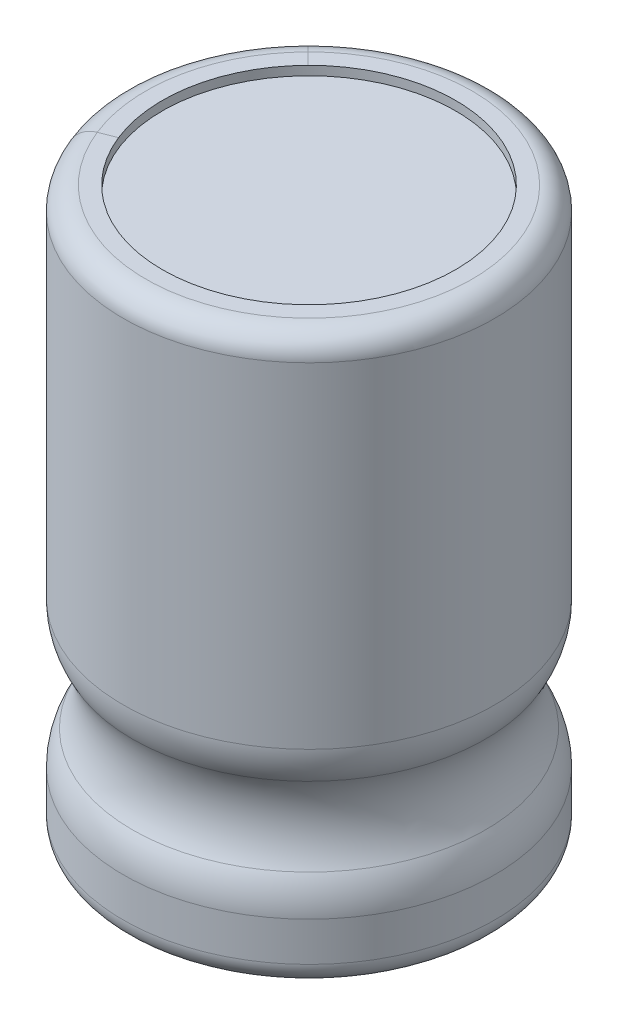
ISO-10303-21;
HEADER;
FILE_DESCRIPTION(('STEP AP214'),'2;1');
FILE_NAME('part.step','',(''),(''),'','','');
FILE_SCHEMA(('AUTOMOTIVE_DESIGN { 1 0 10303 214 1 1 1 1 }'));
ENDSEC;
DATA;
#1=APPLICATION_CONTEXT('core data for automotive mechanical design processes');
#2=APPLICATION_PROTOCOL_DEFINITION('international standard','automotive_design',2000,#1);
#3=PRODUCT_CONTEXT('',#1,'mechanical');
#4=PRODUCT('Part','Part','',(#3));
#5=PRODUCT_RELATED_PRODUCT_CATEGORY('part','',(#4));
#6=PRODUCT_DEFINITION_FORMATION('','',#4);
#7=PRODUCT_DEFINITION_CONTEXT('part definition',#1,'design');
#8=PRODUCT_DEFINITION('design','',#6,#7);
#9=PRODUCT_DEFINITION_SHAPE('','',#8);
#10=(LENGTH_UNIT() NAMED_UNIT(*) SI_UNIT(.MILLI.,.METRE.));
#11=(NAMED_UNIT(*) PLANE_ANGLE_UNIT() SI_UNIT($,.RADIAN.));
#12=(NAMED_UNIT(*) SI_UNIT($,.STERADIAN.) SOLID_ANGLE_UNIT());
#13=UNCERTAINTY_MEASURE_WITH_UNIT(LENGTH_MEASURE(1.E-05),#10,'distance_accuracy_value','');
#14=(GEOMETRIC_REPRESENTATION_CONTEXT(3) GLOBAL_UNCERTAINTY_ASSIGNED_CONTEXT((#13)) GLOBAL_UNIT_ASSIGNED_CONTEXT((#10,
#11,#12)) REPRESENTATION_CONTEXT('',''));
#15=CARTESIAN_POINT('',(0.,0.,0.));
#16=DIRECTION('',(0.,0.,1.));
#17=DIRECTION('',(1.,0.,0.));
#18=AXIS2_PLACEMENT_3D('',#15,#16,#17);
#19=CARTESIAN_POINT('',(0.,0.5,0.));
#20=DIRECTION('',(0.,1.,0.));
#21=DIRECTION('',(0.,0.,1.));
#22=AXIS2_PLACEMENT_3D('',#19,#20,#21);
#23=TOROIDAL_SURFACE('',#22,3.6,0.5);
#24=CARTESIAN_POINT('',(0.,0.,0.));
#25=DIRECTION('',(0.,1.,0.));
#26=DIRECTION('',(0.,0.,1.));
#27=AXIS2_PLACEMENT_3D('',#24,#25,#26);
#28=CIRCLE('',#27,3.6);
#29=CARTESIAN_POINT('',(-2.55822457726929,0.,-2.53288116820654));
#30=VERTEX_POINT('',#29);
#31=CARTESIAN_POINT('',(-3.34559380354316,0.,1.32928631291142));
#32=VERTEX_POINT('',#31);
#33=EDGE_CURVE('E139',#30,#32,#28,.F.);
#34=ORIENTED_EDGE('',*,*,#33,.F.);
#35=CARTESIAN_POINT('',(-2.5582245772693,0.5,-2.53288116820654));
#36=DIRECTION('',(-0.703578102279595,0.,0.71061793813036));
#37=DIRECTION('',(0.71061793813036,0.,0.703578102279595));
#38=AXIS2_PLACEMENT_3D('',#35,#36,#37);
#39=CIRCLE('',#38,0.5);
#40=CARTESIAN_POINT('',(-2.91353354633447,0.5,-2.88467021934634));
#41=VERTEX_POINT('',#40);
#42=EDGE_CURVE('E11',#30,#41,#39,.F.);
#43=ORIENTED_EDGE('',*,*,#42,.T.);
#44=CARTESIAN_POINT('',(0.,0.5,0.));
#45=DIRECTION('',(0.,1.,0.));
#46=DIRECTION('',(0.,0.,1.));
#47=AXIS2_PLACEMENT_3D('',#44,#45,#46);
#48=CIRCLE('',#47,4.1);
#49=CARTESIAN_POINT('',(-3.81025960959082,0.5,1.5139094119269));
#50=VERTEX_POINT('',#49);
#51=EDGE_CURVE('E133',#50,#41,#48,.T.);
#52=ORIENTED_EDGE('',*,*,#51,.F.);
#53=CARTESIAN_POINT('',(-3.34559380354316,0.5,1.32928631291142));
#54=DIRECTION('',(-0.36924619803095,0.,-0.929331612095321));
#55=DIRECTION('',(-0.929331612095321,0.,0.36924619803095));
#56=AXIS2_PLACEMENT_3D('',#53,#54,#55);
#57=CIRCLE('',#56,0.5);
#58=EDGE_CURVE('E48',#50,#32,#57,.F.);
#59=ORIENTED_EDGE('',*,*,#58,.T.);
#60=EDGE_LOOP('',(#34,#43,#52,#59));
#61=FACE_BOUND('',#60,.T.);
#62=ADVANCED_FACE('F38',(#61),#23,.T.);
#63=CARTESIAN_POINT('',(0.,12.5,0.));
#64=DIRECTION('',(0.,-1.,0.));
#65=DIRECTION('',(0.,0.,-1.));
#66=AXIS2_PLACEMENT_3D('',#63,#64,#65);
#67=CYLINDRICAL_SURFACE('',#66,4.1);
#68=DIRECTION('',(0.,-1.,0.));
#69=VECTOR('',#68,1.);
#70=CARTESIAN_POINT('',(-2.91353354633447,12.5,-2.88467021934634));
#71=LINE('',#70,#69);
#72=CARTESIAN_POINT('',(-2.91353354633447,1.3642201591767,-2.88467021934634));
#73=VERTEX_POINT('',#72);
#74=EDGE_CURVE('E165',#73,#41,#71,.T.);
#75=ORIENTED_EDGE('',*,*,#74,.F.);
#76=CARTESIAN_POINT('',(0.,1.3642201591767,0.));
#77=DIRECTION('',(0.,1.,0.));
#78=DIRECTION('',(0.,0.,1.));
#79=AXIS2_PLACEMENT_3D('',#76,#77,#78);
#80=CIRCLE('',#79,4.1);
#81=CARTESIAN_POINT('',(-3.81025960959082,1.3642201591767,1.5139094119269));
#82=VERTEX_POINT('',#81);
#83=EDGE_CURVE('E161',#73,#82,#80,.F.);
#84=ORIENTED_EDGE('',*,*,#83,.T.);
#85=DIRECTION('',(0.,-1.,0.));
#86=VECTOR('',#85,1.);
#87=CARTESIAN_POINT('',(-3.81025960959082,12.5,1.5139094119269));
#88=LINE('',#87,#86);
#89=EDGE_CURVE('E169',#50,#82,#88,.F.);
#90=ORIENTED_EDGE('',*,*,#89,.F.);
#91=ORIENTED_EDGE('',*,*,#51,.T.);
#92=EDGE_LOOP('',(#75,#84,#90,#91));
#93=FACE_BOUND('',#92,.T.);
#94=ADVANCED_FACE('F249',(#93),#67,.T.);
#95=CARTESIAN_POINT('',(0.,1.3642201591767,0.));
#96=DIRECTION('',(0.,1.,0.));
#97=DIRECTION('',(0.,0.,1.));
#98=AXIS2_PLACEMENT_3D('',#95,#96,#97);
#99=TOROIDAL_SURFACE('',#98,2.6,1.5);
#100=ORIENTED_EDGE('',*,*,#83,.F.);
#101=CARTESIAN_POINT('',(-1.84760663913893,1.3642201591767,-1.82930306592695));
#102=DIRECTION('',(-0.703578102279595,0.,0.71061793813036));
#103=DIRECTION('',(0.71061793813036,0.,0.703578102279595));
#104=AXIS2_PLACEMENT_3D('',#101,#102,#103);
#105=CIRCLE('',#104,1.5);
#106=CARTESIAN_POINT('',(-2.76822505052599,2.12028418742968,-2.74080124244572));
#107=VERTEX_POINT('',#106);
#108=EDGE_CURVE('E170',#73,#107,#105,.F.);
#109=ORIENTED_EDGE('',*,*,#108,.T.);
#110=CARTESIAN_POINT('',(0.,2.12028418742968,0.));
#111=DIRECTION('',(0.,1.,0.));
#112=DIRECTION('',(0.,0.,1.));
#113=AXIS2_PLACEMENT_3D('',#110,#111,#112);
#114=CIRCLE('',#113,3.89551811457111);
#115=CARTESIAN_POINT('',(-3.62022812936089,2.12028418742968,1.43840525316608));
#116=VERTEX_POINT('',#115);
#117=EDGE_CURVE('E153',#116,#107,#114,.T.);
#118=ORIENTED_EDGE('',*,*,#117,.F.);
#119=CARTESIAN_POINT('',(-2.41626219144783,1.3642201591767,0.96004011488047));
#120=DIRECTION('',(-0.36924619803095,0.,-0.929331612095321));
#121=DIRECTION('',(-0.929331612095321,0.,0.36924619803095));
#122=AXIS2_PLACEMENT_3D('',#119,#120,#121);
#123=CIRCLE('',#122,1.5);
#124=EDGE_CURVE('E173',#116,#82,#123,.F.);
#125=ORIENTED_EDGE('',*,*,#124,.T.);
#126=EDGE_LOOP('',(#100,#109,#118,#125));
#127=FACE_BOUND('',#126,.T.);
#128=ADVANCED_FACE('F246',(#127),#99,.T.);
#129=CARTESIAN_POINT('',(0.,2.98779587164433,0.));
#130=DIRECTION('',(0.,-1.,0.));
#131=DIRECTION('',(0.,0.,-1.));
#132=AXIS2_PLACEMENT_3D('',#129,#130,#131);
#133=TOROIDAL_SURFACE('',#132,5.38200214172298,1.72110757514648);
#134=CARTESIAN_POINT('',(-3.82454726496436,2.98779587164433,-3.78665885333817));
#135=DIRECTION('',(-0.703578102279595,0.,0.71061793813036));
#136=DIRECTION('',(0.71061793813036,0.,0.703578102279595));
#137=AXIS2_PLACEMENT_3D('',#134,#135,#136);
#138=CIRCLE('',#137,1.72110757514648);
#139=CARTESIAN_POINT('',(-2.76822505052599,3.85530755585897,-2.74080124244573));
#140=VERTEX_POINT('',#139);
#141=EDGE_CURVE('E174',#140,#107,#138,.F.);
#142=ORIENTED_EDGE('',*,*,#141,.F.);
#143=CARTESIAN_POINT('',(0.,3.85530755585897,0.));
#144=DIRECTION('',(0.,-1.,0.));
#145=DIRECTION('',(0.,0.,-1.));
#146=AXIS2_PLACEMENT_3D('',#143,#144,#145);
#147=CIRCLE('',#146,3.89551811457111);
#148=CARTESIAN_POINT('',(-3.62022812936089,3.85530755585897,1.43840525316608));
#149=VERTEX_POINT('',#148);
#150=EDGE_CURVE('E157',#140,#149,#147,.T.);
#151=ORIENTED_EDGE('',*,*,#150,.T.);
#152=CARTESIAN_POINT('',(-5.00166472666789,2.98779587164433,1.98728382862564));
#153=DIRECTION('',(-0.36924619803095,0.,-0.929331612095321));
#154=DIRECTION('',(-0.929331612095321,0.,0.36924619803095));
#155=AXIS2_PLACEMENT_3D('',#152,#153,#154);
#156=CIRCLE('',#155,1.72110757514648);
#157=EDGE_CURVE('E178',#116,#149,#156,.F.);
#158=ORIENTED_EDGE('',*,*,#157,.F.);
#159=ORIENTED_EDGE('',*,*,#117,.T.);
#160=EDGE_LOOP('',(#142,#151,#158,#159));
#161=FACE_BOUND('',#160,.T.);
#162=ADVANCED_FACE('F234',(#161),#133,.F.);
#163=CARTESIAN_POINT('',(0.,4.61137158411196,0.));
#164=DIRECTION('',(0.,-1.,0.));
#165=DIRECTION('',(0.,0.,-1.));
#166=AXIS2_PLACEMENT_3D('',#163,#164,#165);
#167=TOROIDAL_SURFACE('',#166,2.6,1.5);
#168=ORIENTED_EDGE('',*,*,#150,.F.);
#169=CARTESIAN_POINT('',(-1.84760663913893,4.61137158411196,-1.82930306592695));
#170=DIRECTION('',(-0.703578102279595,0.,0.71061793813036));
#171=DIRECTION('',(0.71061793813036,0.,0.703578102279595));
#172=AXIS2_PLACEMENT_3D('',#169,#170,#171);
#173=CIRCLE('',#172,1.5);
#174=CARTESIAN_POINT('',(-2.91353354633447,4.61137158411196,-2.88467021934634));
#175=VERTEX_POINT('',#174);
#176=EDGE_CURVE('E179',#140,#175,#173,.F.);
#177=ORIENTED_EDGE('',*,*,#176,.T.);
#178=CARTESIAN_POINT('',(0.,4.61137158411196,0.));
#179=DIRECTION('',(0.,-1.,0.));
#180=DIRECTION('',(0.,0.,-1.));
#181=AXIS2_PLACEMENT_3D('',#178,#179,#180);
#182=CIRCLE('',#181,4.1);
#183=CARTESIAN_POINT('',(-3.81025960959082,4.61137158411196,1.5139094119269));
#184=VERTEX_POINT('',#183);
#185=EDGE_CURVE('E149',#184,#175,#182,.F.);
#186=ORIENTED_EDGE('',*,*,#185,.F.);
#187=CARTESIAN_POINT('',(-2.41626219144783,4.61137158411196,0.96004011488047));
#188=DIRECTION('',(-0.36924619803095,0.,-0.929331612095321));
#189=DIRECTION('',(-0.929331612095321,0.,0.36924619803095));
#190=AXIS2_PLACEMENT_3D('',#187,#188,#189);
#191=CIRCLE('',#190,1.5);
#192=EDGE_CURVE('E182',#184,#149,#191,.F.);
#193=ORIENTED_EDGE('',*,*,#192,.T.);
#194=EDGE_LOOP('',(#168,#177,#186,#193));
#195=FACE_BOUND('',#194,.T.);
#196=ADVANCED_FACE('F231',(#195),#167,.T.);
#197=DIRECTION('',(0.,-1.,0.));
#198=VECTOR('',#197,1.);
#199=CARTESIAN_POINT('',(-2.91353354633447,12.5,-2.88467021934634));
#200=LINE('',#199,#198);
#201=CARTESIAN_POINT('',(-2.91353354633447,12.,-2.88467021934634));
#202=VERTEX_POINT('',#201);
#203=EDGE_CURVE('E183',#202,#175,#200,.T.);
#204=ORIENTED_EDGE('',*,*,#203,.F.);
#205=CARTESIAN_POINT('',(0.,12.,0.));
#206=DIRECTION('',(0.,1.,0.));
#207=DIRECTION('',(0.,0.,1.));
#208=AXIS2_PLACEMENT_3D('',#205,#206,#207);
#209=CIRCLE('',#208,4.1);
#210=CARTESIAN_POINT('',(-3.81025960959082,12.,1.5139094119269));
#211=VERTEX_POINT('',#210);
#212=EDGE_CURVE('E145',#202,#211,#209,.F.);
#213=ORIENTED_EDGE('',*,*,#212,.T.);
#214=DIRECTION('',(0.,-1.,0.));
#215=VECTOR('',#214,1.);
#216=CARTESIAN_POINT('',(-3.81025960959082,12.5,1.5139094119269));
#217=LINE('',#216,#215);
#218=EDGE_CURVE('E187',#184,#211,#217,.F.);
#219=ORIENTED_EDGE('',*,*,#218,.F.);
#220=ORIENTED_EDGE('',*,*,#185,.T.);
#221=EDGE_LOOP('',(#204,#213,#219,#220));
#222=FACE_BOUND('',#221,.T.);
#223=ADVANCED_FACE('F216',(#222),#67,.T.);
#224=CARTESIAN_POINT('',(0.,12.,0.));
#225=DIRECTION('',(0.,1.,0.));
#226=DIRECTION('',(0.,0.,1.));
#227=AXIS2_PLACEMENT_3D('',#224,#225,#226);
#228=TOROIDAL_SURFACE('',#227,3.6,0.5);
#229=ORIENTED_EDGE('',*,*,#212,.F.);
#230=CARTESIAN_POINT('',(-2.5582245772693,12.,-2.53288116820654));
#231=DIRECTION('',(-0.703578102279595,0.,0.71061793813036));
#232=DIRECTION('',(0.71061793813036,0.,0.703578102279595));
#233=AXIS2_PLACEMENT_3D('',#230,#231,#232);
#234=CIRCLE('',#233,0.5);
#235=CARTESIAN_POINT('',(-2.5582245772693,12.5,-2.53288116820654));
#236=VERTEX_POINT('',#235);
#237=EDGE_CURVE('E188',#202,#236,#234,.F.);
#238=ORIENTED_EDGE('',*,*,#237,.T.);
#239=CARTESIAN_POINT('',(0.,12.5,0.));
#240=DIRECTION('',(0.,1.,0.));
#241=DIRECTION('',(0.,0.,1.));
#242=AXIS2_PLACEMENT_3D('',#239,#240,#241);
#243=CIRCLE('',#242,3.6);
#244=CARTESIAN_POINT('',(-3.34559380354316,12.5,1.32928631291142));
#245=VERTEX_POINT('',#244);
#246=EDGE_CURVE('E118',#245,#236,#243,.T.);
#247=ORIENTED_EDGE('',*,*,#246,.F.);
#248=CARTESIAN_POINT('',(-3.34559380354316,12.,1.32928631291142));
#249=DIRECTION('',(-0.36924619803095,0.,-0.929331612095321));
#250=DIRECTION('',(-0.929331612095321,0.,0.36924619803095));
#251=AXIS2_PLACEMENT_3D('',#248,#249,#250);
#252=CIRCLE('',#251,0.5);
#253=EDGE_CURVE('E124',#245,#211,#252,.F.);
#254=ORIENTED_EDGE('',*,*,#253,.T.);
#255=EDGE_LOOP('',(#229,#238,#247,#254));
#256=FACE_BOUND('',#255,.T.);
#257=ADVANCED_FACE('F211',(#256),#228,.T.);
#258=CARTESIAN_POINT('',(0.,12.5,0.));
#259=DIRECTION('',(0.,1.,0.));
#260=DIRECTION('',(0.,0.,1.));
#261=AXIS2_PLACEMENT_3D('',#258,#259,#260);
#262=PLANE('',#261);
#263=ORIENTED_EDGE('',*,*,#246,.T.);
#264=DIRECTION('',(0.71061793813036,0.,0.703578102279595));
#265=VECTOR('',#264,1.);
#266=CARTESIAN_POINT('',(0.,12.5,0.));
#267=LINE('',#266,#265);
#268=CARTESIAN_POINT('',(-2.3002480800384,12.5,-2.2774603511751));
#269=VERTEX_POINT('',#268);
#270=EDGE_CURVE('E111',#236,#269,#267,.T.);
#271=ORIENTED_EDGE('',*,*,#270,.T.);
#272=CARTESIAN_POINT('',(0.,12.5,0.));
#273=DIRECTION('',(0.,1.,0.));
#274=DIRECTION('',(0.,0.,1.));
#275=AXIS2_PLACEMENT_3D('',#272,#273,#274);
#276=CIRCLE('',#275,3.236968779722);
#277=CARTESIAN_POINT('',(-3.00821741436127,12.5,1.19523841505723));
#278=VERTEX_POINT('',#277);
#279=EDGE_CURVE('E115',#278,#269,#276,.T.);
#280=ORIENTED_EDGE('',*,*,#279,.F.);
#281=DIRECTION('',(-0.929331612095321,0.,0.36924619803095));
#282=VECTOR('',#281,1.);
#283=CARTESIAN_POINT('',(0.,12.5,0.));
#284=LINE('',#283,#282);
#285=EDGE_CURVE('E42',#278,#245,#284,.T.);
#286=ORIENTED_EDGE('',*,*,#285,.T.);
#287=EDGE_LOOP('',(#263,#271,#280,#286));
#288=FACE_BOUND('',#287,.T.);
#289=ADVANCED_FACE('F113',(#288),#262,.T.);
#290=EDGE_CURVE('E162',#82,#73,#80,.F.);
#291=ORIENTED_EDGE('',*,*,#290,.T.);
#292=ORIENTED_EDGE('',*,*,#74,.T.);
#293=EDGE_CURVE('E136',#41,#50,#48,.T.);
#294=ORIENTED_EDGE('',*,*,#293,.T.);
#295=ORIENTED_EDGE('',*,*,#89,.T.);
#296=EDGE_LOOP('',(#291,#292,#294,#295));
#297=FACE_BOUND('',#296,.T.);
#298=ADVANCED_FACE('F252',(#297),#67,.T.);
#299=CARTESIAN_POINT('',(0.,0.,0.));
#300=DIRECTION('',(0.,1.,0.));
#301=DIRECTION('',(0.,0.,1.));
#302=AXIS2_PLACEMENT_3D('',#299,#300,#301);
#303=PLANE('',#302);
#304=EDGE_CURVE('E140',#32,#30,#28,.F.);
#305=ORIENTED_EDGE('',*,*,#304,.T.);
#306=ORIENTED_EDGE('',*,*,#33,.T.);
#307=EDGE_LOOP('',(#305,#306));
#308=FACE_BOUND('',#307,.T.);
#309=ADVANCED_FACE('F255',(#308),#303,.F.);
#310=EDGE_CURVE('E158',#149,#140,#147,.T.);
#311=ORIENTED_EDGE('',*,*,#310,.T.);
#312=ORIENTED_EDGE('',*,*,#141,.T.);
#313=EDGE_CURVE('E154',#107,#116,#114,.T.);
#314=ORIENTED_EDGE('',*,*,#313,.T.);
#315=ORIENTED_EDGE('',*,*,#157,.T.);
#316=EDGE_LOOP('',(#311,#312,#314,#315));
#317=FACE_BOUND('',#316,.T.);
#318=ADVANCED_FACE('F239',(#317),#133,.F.);
#319=ORIENTED_EDGE('',*,*,#270,.F.);
#320=EDGE_CURVE('E143',#236,#245,#243,.T.);
#321=ORIENTED_EDGE('',*,*,#320,.T.);
#322=ORIENTED_EDGE('',*,*,#285,.F.);
#323=EDGE_CURVE('E128',#269,#278,#276,.T.);
#324=ORIENTED_EDGE('',*,*,#323,.F.);
#325=EDGE_LOOP('',(#319,#321,#322,#324));
#326=FACE_BOUND('',#325,.T.);
#327=ADVANCED_FACE('F130',(#326),#262,.T.);
#328=EDGE_CURVE('E146',#211,#202,#209,.F.);
#329=ORIENTED_EDGE('',*,*,#328,.T.);
#330=ORIENTED_EDGE('',*,*,#203,.T.);
#331=EDGE_CURVE('E150',#175,#184,#182,.F.);
#332=ORIENTED_EDGE('',*,*,#331,.T.);
#333=ORIENTED_EDGE('',*,*,#218,.T.);
#334=EDGE_LOOP('',(#329,#330,#332,#333));
#335=FACE_BOUND('',#334,.T.);
#336=ADVANCED_FACE('F222',(#335),#67,.T.);
#337=ORIENTED_EDGE('',*,*,#42,.F.);
#338=ORIENTED_EDGE('',*,*,#304,.F.);
#339=ORIENTED_EDGE('',*,*,#58,.F.);
#340=ORIENTED_EDGE('',*,*,#293,.F.);
#341=EDGE_LOOP('',(#337,#338,#339,#340));
#342=FACE_BOUND('',#341,.T.);
#343=ADVANCED_FACE('F253',(#342),#23,.T.);
#344=ORIENTED_EDGE('',*,*,#237,.F.);
#345=ORIENTED_EDGE('',*,*,#328,.F.);
#346=ORIENTED_EDGE('',*,*,#253,.F.);
#347=ORIENTED_EDGE('',*,*,#320,.F.);
#348=EDGE_LOOP('',(#344,#345,#346,#347));
#349=FACE_BOUND('',#348,.T.);
#350=ADVANCED_FACE('F220',(#349),#228,.T.);
#351=ORIENTED_EDGE('',*,*,#176,.F.);
#352=ORIENTED_EDGE('',*,*,#310,.F.);
#353=ORIENTED_EDGE('',*,*,#192,.F.);
#354=ORIENTED_EDGE('',*,*,#331,.F.);
#355=EDGE_LOOP('',(#351,#352,#353,#354));
#356=FACE_BOUND('',#355,.T.);
#357=ADVANCED_FACE('F226',(#356),#167,.T.);
#358=ORIENTED_EDGE('',*,*,#108,.F.);
#359=ORIENTED_EDGE('',*,*,#290,.F.);
#360=ORIENTED_EDGE('',*,*,#124,.F.);
#361=ORIENTED_EDGE('',*,*,#313,.F.);
#362=EDGE_LOOP('',(#358,#359,#360,#361));
#363=FACE_BOUND('',#362,.T.);
#364=ADVANCED_FACE('F40',(#363),#99,.T.);
#365=CARTESIAN_POINT('',(0.,12.3,0.));
#366=DIRECTION('',(0.,1.,0.));
#367=DIRECTION('',(0.,0.,1.));
#368=AXIS2_PLACEMENT_3D('',#365,#366,#367);
#369=CYLINDRICAL_SURFACE('',#368,3.236968779722);
#370=CARTESIAN_POINT('',(0.,12.3,0.));
#371=DIRECTION('',(0.,1.,0.));
#372=DIRECTION('',(0.,0.,1.));
#373=AXIS2_PLACEMENT_3D('',#370,#371,#372);
#374=CIRCLE('',#373,3.236968779722);
#375=CARTESIAN_POINT('',(0.,12.3,3.236968779722));
#376=VERTEX_POINT('',#375);
#377=EDGE_CURVE('E131',#376,#376,#374,.T.);
#378=ORIENTED_EDGE('',*,*,#377,.F.);
#379=EDGE_LOOP('',(#378));
#380=FACE_BOUND('',#379,.T.);
#381=ORIENTED_EDGE('',*,*,#323,.T.);
#382=ORIENTED_EDGE('',*,*,#279,.T.);
#383=EDGE_LOOP('',(#381,#382));
#384=FACE_BOUND('',#383,.T.);
#385=ADVANCED_FACE('F127',(#380,#384),#369,.F.);
#386=CARTESIAN_POINT('',(0.,12.3,0.));
#387=DIRECTION('',(0.,1.,0.));
#388=DIRECTION('',(0.,0.,1.));
#389=AXIS2_PLACEMENT_3D('',#386,#387,#388);
#390=PLANE('',#389);
#391=ORIENTED_EDGE('',*,*,#377,.T.);
#392=EDGE_LOOP('',(#391));
#393=FACE_BOUND('',#392,.T.);
#394=ADVANCED_FACE('F294',(#393),#390,.T.);
#395=CLOSED_SHELL('',(#62,#94,#128,#162,#196,#223,#257,#289,#298,#309,#318,#327,#336,#343,#350,
#357,#364,#385,#394));
#396=MANIFOLD_SOLID_BREP('B2',#395);
#397=ADVANCED_BREP_SHAPE_REPRESENTATION('',(#18,#396),#14);
#398=SHAPE_DEFINITION_REPRESENTATION(#9,#397);
ENDSEC;
END-ISO-10303-21;
